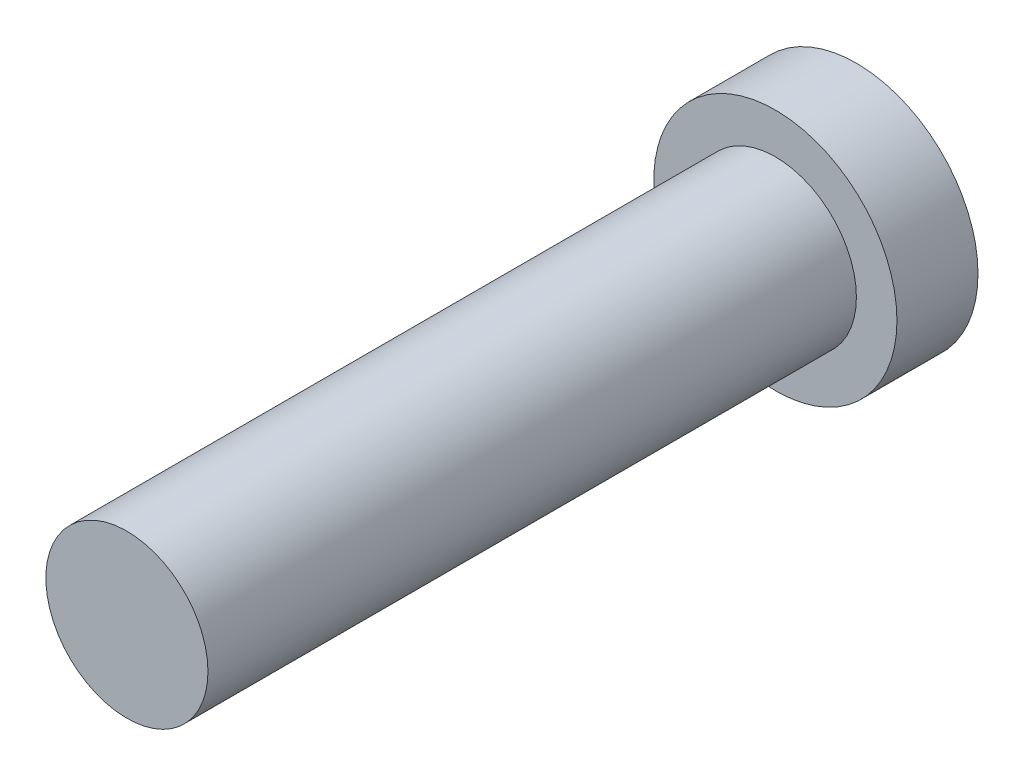
ISO-10303-21;
HEADER;
FILE_DESCRIPTION(('STEP AP214'),'2;1');
FILE_NAME('part.step','',(''),(''),'','','');
FILE_SCHEMA(('AUTOMOTIVE_DESIGN { 1 0 10303 214 1 1 1 1 }'));
ENDSEC;
DATA;
#1=APPLICATION_CONTEXT('core data for automotive mechanical design processes');
#2=APPLICATION_PROTOCOL_DEFINITION('international standard','automotive_design',2000,#1);
#3=PRODUCT_CONTEXT('',#1,'mechanical');
#4=PRODUCT('Part','Part','',(#3));
#5=PRODUCT_RELATED_PRODUCT_CATEGORY('part','',(#4));
#6=PRODUCT_DEFINITION_FORMATION('','',#4);
#7=PRODUCT_DEFINITION_CONTEXT('part definition',#1,'design');
#8=PRODUCT_DEFINITION('design','',#6,#7);
#9=PRODUCT_DEFINITION_SHAPE('','',#8);
#10=(LENGTH_UNIT() NAMED_UNIT(*) SI_UNIT(.MILLI.,.METRE.));
#11=(NAMED_UNIT(*) PLANE_ANGLE_UNIT() SI_UNIT($,.RADIAN.));
#12=(NAMED_UNIT(*) SI_UNIT($,.STERADIAN.) SOLID_ANGLE_UNIT());
#13=UNCERTAINTY_MEASURE_WITH_UNIT(LENGTH_MEASURE(1.E-05),#10,'distance_accuracy_value','');
#14=(GEOMETRIC_REPRESENTATION_CONTEXT(3) GLOBAL_UNCERTAINTY_ASSIGNED_CONTEXT((#13)) GLOBAL_UNIT_ASSIGNED_CONTEXT((#10,
#11,#12)) REPRESENTATION_CONTEXT('',''));
#15=CARTESIAN_POINT('',(0.,0.,0.));
#16=DIRECTION('',(0.,0.,1.));
#17=DIRECTION('',(1.,0.,0.));
#18=AXIS2_PLACEMENT_3D('',#15,#16,#17);
#19=CARTESIAN_POINT('',(0.,0.,6.35));
#20=DIRECTION('',(0.,0.,-1.));
#21=DIRECTION('',(-1.,0.,0.));
#22=AXIS2_PLACEMENT_3D('',#19,#20,#21);
#23=CYLINDRICAL_SURFACE('',#22,19.05);
#24=CARTESIAN_POINT('',(0.,0.,6.35));
#25=DIRECTION('',(0.,0.,1.));
#26=DIRECTION('',(1.,0.,0.));
#27=AXIS2_PLACEMENT_3D('',#24,#25,#26);
#28=CIRCLE('',#27,19.05);
#29=CARTESIAN_POINT('',(19.05,0.,6.35));
#30=VERTEX_POINT('',#29);
#31=EDGE_CURVE('E45',#30,#30,#28,.T.);
#32=ORIENTED_EDGE('',*,*,#31,.F.);
#33=EDGE_LOOP('',(#32));
#34=FACE_BOUND('',#33,.T.);
#35=CARTESIAN_POINT('',(0.,0.,-6.35));
#36=DIRECTION('',(0.,0.,1.));
#37=DIRECTION('',(1.,0.,0.));
#38=AXIS2_PLACEMENT_3D('',#35,#36,#37);
#39=CIRCLE('',#38,19.05);
#40=CARTESIAN_POINT('',(19.05,0.,-6.35));
#41=VERTEX_POINT('',#40);
#42=EDGE_CURVE('E40',#41,#41,#39,.T.);
#43=ORIENTED_EDGE('',*,*,#42,.T.);
#44=EDGE_LOOP('',(#43));
#45=FACE_BOUND('',#44,.T.);
#46=ADVANCED_FACE('F37',(#34,#45),#23,.T.);
#47=CARTESIAN_POINT('',(0.,0.,6.35));
#48=DIRECTION('',(0.,0.,1.));
#49=DIRECTION('',(1.,0.,0.));
#50=AXIS2_PLACEMENT_3D('',#47,#48,#49);
#51=PLANE('',#50);
#52=CARTESIAN_POINT('',(0.,0.,6.35));
#53=DIRECTION('',(0.,0.,1.));
#54=DIRECTION('',(1.,0.,0.));
#55=AXIS2_PLACEMENT_3D('',#52,#53,#54);
#56=CIRCLE('',#55,12.7);
#57=CARTESIAN_POINT('',(12.7,0.,6.35));
#58=VERTEX_POINT('',#57);
#59=EDGE_CURVE('E10',#58,#58,#56,.T.);
#60=ORIENTED_EDGE('',*,*,#59,.F.);
#61=EDGE_LOOP('',(#60));
#62=FACE_BOUND('',#61,.T.);
#63=ORIENTED_EDGE('',*,*,#31,.T.);
#64=EDGE_LOOP('',(#63));
#65=FACE_BOUND('',#64,.T.);
#66=ADVANCED_FACE('F65',(#62,#65),#51,.T.);
#67=CARTESIAN_POINT('',(0.,0.,-6.35));
#68=DIRECTION('',(0.,0.,1.));
#69=DIRECTION('',(1.,0.,0.));
#70=AXIS2_PLACEMENT_3D('',#67,#68,#69);
#71=PLANE('',#70);
#72=ORIENTED_EDGE('',*,*,#42,.F.);
#73=EDGE_LOOP('',(#72));
#74=FACE_BOUND('',#73,.T.);
#75=ADVANCED_FACE('F62',(#74),#71,.F.);
#76=CARTESIAN_POINT('',(0.,0.,107.95));
#77=DIRECTION('',(0.,0.,-1.));
#78=DIRECTION('',(-1.,0.,0.));
#79=AXIS2_PLACEMENT_3D('',#76,#77,#78);
#80=CYLINDRICAL_SURFACE('',#79,12.7);
#81=CARTESIAN_POINT('',(0.,0.,107.95));
#82=DIRECTION('',(0.,0.,1.));
#83=DIRECTION('',(1.,0.,0.));
#84=AXIS2_PLACEMENT_3D('',#81,#82,#83);
#85=CIRCLE('',#84,12.7);
#86=CARTESIAN_POINT('',(12.7,0.,107.95));
#87=VERTEX_POINT('',#86);
#88=EDGE_CURVE('E52',#87,#87,#85,.T.);
#89=ORIENTED_EDGE('',*,*,#88,.F.);
#90=EDGE_LOOP('',(#89));
#91=FACE_BOUND('',#90,.T.);
#92=ORIENTED_EDGE('',*,*,#59,.T.);
#93=EDGE_LOOP('',(#92));
#94=FACE_BOUND('',#93,.T.);
#95=ADVANCED_FACE('F64',(#91,#94),#80,.T.);
#96=CARTESIAN_POINT('',(0.,0.,107.95));
#97=DIRECTION('',(0.,0.,1.));
#98=DIRECTION('',(1.,0.,0.));
#99=AXIS2_PLACEMENT_3D('',#96,#97,#98);
#100=PLANE('',#99);
#101=ORIENTED_EDGE('',*,*,#88,.T.);
#102=EDGE_LOOP('',(#101));
#103=FACE_BOUND('',#102,.T.);
#104=ADVANCED_FACE('F70',(#103),#100,.T.);
#105=CLOSED_SHELL('',(#46,#66,#75,#95,#104));
#106=MANIFOLD_SOLID_BREP('B2',#105);
#107=ADVANCED_BREP_SHAPE_REPRESENTATION('',(#18,#106),#14);
#108=SHAPE_DEFINITION_REPRESENTATION(#9,#107);
ENDSEC;
END-ISO-10303-21;
